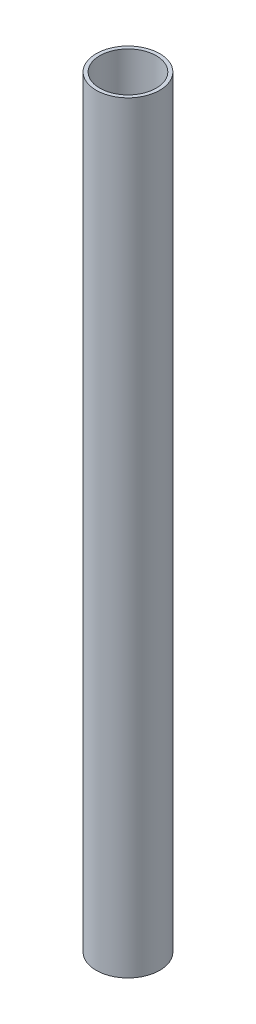
ISO-10303-21;
HEADER;
FILE_DESCRIPTION(('STEP AP214'),'2;1');
FILE_NAME('part.step','',(''),(''),'','','');
FILE_SCHEMA(('AUTOMOTIVE_DESIGN { 1 0 10303 214 1 1 1 1 }'));
ENDSEC;
DATA;
#1=APPLICATION_CONTEXT('core data for automotive mechanical design processes');
#2=APPLICATION_PROTOCOL_DEFINITION('international standard','automotive_design',2000,#1);
#3=PRODUCT_CONTEXT('',#1,'mechanical');
#4=PRODUCT('Part','Part','',(#3));
#5=PRODUCT_RELATED_PRODUCT_CATEGORY('part','',(#4));
#6=PRODUCT_DEFINITION_FORMATION('','',#4);
#7=PRODUCT_DEFINITION_CONTEXT('part definition',#1,'design');
#8=PRODUCT_DEFINITION('design','',#6,#7);
#9=PRODUCT_DEFINITION_SHAPE('','',#8);
#10=(LENGTH_UNIT() NAMED_UNIT(*) SI_UNIT(.MILLI.,.METRE.));
#11=(NAMED_UNIT(*) PLANE_ANGLE_UNIT() SI_UNIT($,.RADIAN.));
#12=(NAMED_UNIT(*) SI_UNIT($,.STERADIAN.) SOLID_ANGLE_UNIT());
#13=UNCERTAINTY_MEASURE_WITH_UNIT(LENGTH_MEASURE(1.E-05),#10,'distance_accuracy_value','');
#14=(GEOMETRIC_REPRESENTATION_CONTEXT(3) GLOBAL_UNCERTAINTY_ASSIGNED_CONTEXT((#13)) GLOBAL_UNIT_ASSIGNED_CONTEXT((#10,
#11,#12)) REPRESENTATION_CONTEXT('',''));
#15=CARTESIAN_POINT('',(0.,0.,0.));
#16=DIRECTION('',(0.,0.,1.));
#17=DIRECTION('',(1.,0.,0.));
#18=AXIS2_PLACEMENT_3D('',#15,#16,#17);
#19=CARTESIAN_POINT('',(0.,152.4,0.));
#20=DIRECTION('',(0.,1.,0.));
#21=DIRECTION('',(0.,0.,1.));
#22=AXIS2_PLACEMENT_3D('',#19,#20,#21);
#23=PLANE('',#22);
#24=CARTESIAN_POINT('',(0.,152.4,0.));
#25=DIRECTION('',(0.,1.,0.));
#26=DIRECTION('',(0.,0.,1.));
#27=AXIS2_PLACEMENT_3D('',#24,#25,#26);
#28=CIRCLE('',#27,6.35);
#29=CARTESIAN_POINT('',(0.,152.4,6.35));
#30=VERTEX_POINT('',#29);
#31=EDGE_CURVE('E10',#30,#30,#28,.T.);
#32=ORIENTED_EDGE('',*,*,#31,.T.);
#33=EDGE_LOOP('',(#32));
#34=FACE_BOUND('',#33,.T.);
#35=CARTESIAN_POINT('',(0.,152.4,0.));
#36=DIRECTION('',(0.,1.,0.));
#37=DIRECTION('',(0.,0.,1.));
#38=AXIS2_PLACEMENT_3D('',#35,#36,#37);
#39=CIRCLE('',#38,5.6388);
#40=CARTESIAN_POINT('',(0.,152.4,5.6388));
#41=VERTEX_POINT('',#40);
#42=EDGE_CURVE('E42',#41,#41,#39,.T.);
#43=ORIENTED_EDGE('',*,*,#42,.F.);
#44=EDGE_LOOP('',(#43));
#45=FACE_BOUND('',#44,.T.);
#46=ADVANCED_FACE('F31',(#34,#45),#23,.T.);
#47=CARTESIAN_POINT('',(0.,0.,0.));
#48=DIRECTION('',(0.,1.,0.));
#49=DIRECTION('',(0.,0.,1.));
#50=AXIS2_PLACEMENT_3D('',#47,#48,#49);
#51=PLANE('',#50);
#52=CARTESIAN_POINT('',(0.,0.,0.));
#53=DIRECTION('',(0.,1.,0.));
#54=DIRECTION('',(0.,0.,1.));
#55=AXIS2_PLACEMENT_3D('',#52,#53,#54);
#56=CIRCLE('',#55,6.35);
#57=CARTESIAN_POINT('',(0.,0.,6.35));
#58=VERTEX_POINT('',#57);
#59=EDGE_CURVE('E35',#58,#58,#56,.T.);
#60=ORIENTED_EDGE('',*,*,#59,.F.);
#61=EDGE_LOOP('',(#60));
#62=FACE_BOUND('',#61,.T.);
#63=CARTESIAN_POINT('',(0.,0.,0.));
#64=DIRECTION('',(0.,1.,0.));
#65=DIRECTION('',(0.,0.,1.));
#66=AXIS2_PLACEMENT_3D('',#63,#64,#65);
#67=CIRCLE('',#66,5.6388);
#68=CARTESIAN_POINT('',(0.,0.,5.6388));
#69=VERTEX_POINT('',#68);
#70=EDGE_CURVE('E44',#69,#69,#67,.T.);
#71=ORIENTED_EDGE('',*,*,#70,.T.);
#72=EDGE_LOOP('',(#71));
#73=FACE_BOUND('',#72,.T.);
#74=ADVANCED_FACE('F54',(#62,#73),#51,.F.);
#75=CARTESIAN_POINT('',(0.,152.4,0.));
#76=DIRECTION('',(0.,-1.,0.));
#77=DIRECTION('',(0.,0.,-1.));
#78=AXIS2_PLACEMENT_3D('',#75,#76,#77);
#79=CYLINDRICAL_SURFACE('',#78,6.35);
#80=ORIENTED_EDGE('',*,*,#31,.F.);
#81=EDGE_LOOP('',(#80));
#82=FACE_BOUND('',#81,.T.);
#83=ORIENTED_EDGE('',*,*,#59,.T.);
#84=EDGE_LOOP('',(#83));
#85=FACE_BOUND('',#84,.T.);
#86=ADVANCED_FACE('F33',(#82,#85),#79,.T.);
#87=CARTESIAN_POINT('',(0.,152.4,0.));
#88=DIRECTION('',(0.,-1.,0.));
#89=DIRECTION('',(0.,0.,-1.));
#90=AXIS2_PLACEMENT_3D('',#87,#88,#89);
#91=CYLINDRICAL_SURFACE('',#90,5.6388);
#92=ORIENTED_EDGE('',*,*,#42,.T.);
#93=EDGE_LOOP('',(#92));
#94=FACE_BOUND('',#93,.T.);
#95=ORIENTED_EDGE('',*,*,#70,.F.);
#96=EDGE_LOOP('',(#95));
#97=FACE_BOUND('',#96,.T.);
#98=ADVANCED_FACE('F50',(#94,#97),#91,.F.);
#99=CLOSED_SHELL('',(#46,#74,#86,#98));
#100=MANIFOLD_SOLID_BREP('B2',#99);
#101=ADVANCED_BREP_SHAPE_REPRESENTATION('',(#18,#100),#14);
#102=SHAPE_DEFINITION_REPRESENTATION(#9,#101);
ENDSEC;
END-ISO-10303-21;
